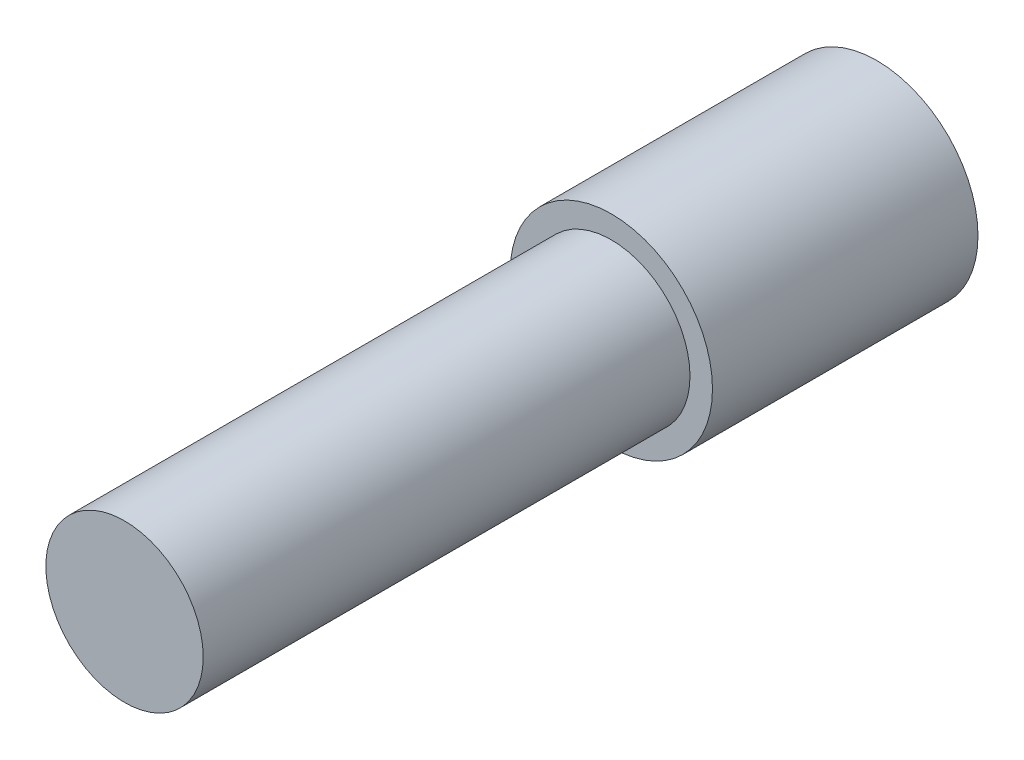
ISO-10303-21;
HEADER;
FILE_DESCRIPTION(('STEP AP214'),'2;1');
FILE_NAME('part.step','',(''),(''),'','','');
FILE_SCHEMA(('AUTOMOTIVE_DESIGN { 1 0 10303 214 1 1 1 1 }'));
ENDSEC;
DATA;
#1=APPLICATION_CONTEXT('core data for automotive mechanical design processes');
#2=APPLICATION_PROTOCOL_DEFINITION('international standard','automotive_design',2000,#1);
#3=PRODUCT_CONTEXT('',#1,'mechanical');
#4=PRODUCT('Part','Part','',(#3));
#5=PRODUCT_RELATED_PRODUCT_CATEGORY('part','',(#4));
#6=PRODUCT_DEFINITION_FORMATION('','',#4);
#7=PRODUCT_DEFINITION_CONTEXT('part definition',#1,'design');
#8=PRODUCT_DEFINITION('design','',#6,#7);
#9=PRODUCT_DEFINITION_SHAPE('','',#8);
#10=(LENGTH_UNIT() NAMED_UNIT(*) SI_UNIT(.MILLI.,.METRE.));
#11=(NAMED_UNIT(*) PLANE_ANGLE_UNIT() SI_UNIT($,.RADIAN.));
#12=(NAMED_UNIT(*) SI_UNIT($,.STERADIAN.) SOLID_ANGLE_UNIT());
#13=UNCERTAINTY_MEASURE_WITH_UNIT(LENGTH_MEASURE(1.E-05),#10,'distance_accuracy_value','');
#14=(GEOMETRIC_REPRESENTATION_CONTEXT(3) GLOBAL_UNCERTAINTY_ASSIGNED_CONTEXT((#13)) GLOBAL_UNIT_ASSIGNED_CONTEXT((#10,
#11,#12)) REPRESENTATION_CONTEXT('',''));
#15=CARTESIAN_POINT('',(0.,0.,0.));
#16=DIRECTION('',(0.,0.,1.));
#17=DIRECTION('',(1.,0.,0.));
#18=AXIS2_PLACEMENT_3D('',#15,#16,#17);
#19=CARTESIAN_POINT('',(0.,0.,6.));
#20=DIRECTION('',(0.,0.,-1.));
#21=DIRECTION('',(-1.,0.,0.));
#22=AXIS2_PLACEMENT_3D('',#19,#20,#21);
#23=CYLINDRICAL_SURFACE('',#22,2.286);
#24=CARTESIAN_POINT('',(0.,0.,6.));
#25=DIRECTION('',(0.,0.,1.));
#26=DIRECTION('',(1.,0.,0.));
#27=AXIS2_PLACEMENT_3D('',#24,#25,#26);
#28=CIRCLE('',#27,2.286);
#29=CARTESIAN_POINT('',(2.286,0.,6.));
#30=VERTEX_POINT('',#29);
#31=EDGE_CURVE('E45',#30,#30,#28,.T.);
#32=ORIENTED_EDGE('',*,*,#31,.F.);
#33=EDGE_LOOP('',(#32));
#34=FACE_BOUND('',#33,.T.);
#35=CARTESIAN_POINT('',(0.,0.,0.));
#36=DIRECTION('',(0.,0.,1.));
#37=DIRECTION('',(1.,0.,0.));
#38=AXIS2_PLACEMENT_3D('',#35,#36,#37);
#39=CIRCLE('',#38,2.286);
#40=CARTESIAN_POINT('',(2.286,0.,0.));
#41=VERTEX_POINT('',#40);
#42=EDGE_CURVE('E40',#41,#41,#39,.T.);
#43=ORIENTED_EDGE('',*,*,#42,.T.);
#44=EDGE_LOOP('',(#43));
#45=FACE_BOUND('',#44,.T.);
#46=ADVANCED_FACE('F37',(#34,#45),#23,.T.);
#47=CARTESIAN_POINT('',(0.,0.,6.));
#48=DIRECTION('',(0.,0.,1.));
#49=DIRECTION('',(1.,0.,0.));
#50=AXIS2_PLACEMENT_3D('',#47,#48,#49);
#51=PLANE('',#50);
#52=CARTESIAN_POINT('',(0.,0.,6.));
#53=DIRECTION('',(0.,0.,1.));
#54=DIRECTION('',(1.,0.,0.));
#55=AXIS2_PLACEMENT_3D('',#52,#53,#54);
#56=CIRCLE('',#55,1.778);
#57=CARTESIAN_POINT('',(1.778,0.,6.));
#58=VERTEX_POINT('',#57);
#59=EDGE_CURVE('E10',#58,#58,#56,.T.);
#60=ORIENTED_EDGE('',*,*,#59,.F.);
#61=EDGE_LOOP('',(#60));
#62=FACE_BOUND('',#61,.T.);
#63=ORIENTED_EDGE('',*,*,#31,.T.);
#64=EDGE_LOOP('',(#63));
#65=FACE_BOUND('',#64,.T.);
#66=ADVANCED_FACE('F65',(#62,#65),#51,.T.);
#67=CARTESIAN_POINT('',(0.,0.,0.));
#68=DIRECTION('',(0.,0.,1.));
#69=DIRECTION('',(1.,0.,0.));
#70=AXIS2_PLACEMENT_3D('',#67,#68,#69);
#71=PLANE('',#70);
#72=ORIENTED_EDGE('',*,*,#42,.F.);
#73=EDGE_LOOP('',(#72));
#74=FACE_BOUND('',#73,.T.);
#75=ADVANCED_FACE('F62',(#74),#71,.F.);
#76=CARTESIAN_POINT('',(0.,0.,17.));
#77=DIRECTION('',(0.,0.,-1.));
#78=DIRECTION('',(-1.,0.,0.));
#79=AXIS2_PLACEMENT_3D('',#76,#77,#78);
#80=CYLINDRICAL_SURFACE('',#79,1.778);
#81=CARTESIAN_POINT('',(0.,0.,17.));
#82=DIRECTION('',(0.,0.,1.));
#83=DIRECTION('',(1.,0.,0.));
#84=AXIS2_PLACEMENT_3D('',#81,#82,#83);
#85=CIRCLE('',#84,1.778);
#86=CARTESIAN_POINT('',(1.778,0.,17.));
#87=VERTEX_POINT('',#86);
#88=EDGE_CURVE('E52',#87,#87,#85,.T.);
#89=ORIENTED_EDGE('',*,*,#88,.F.);
#90=EDGE_LOOP('',(#89));
#91=FACE_BOUND('',#90,.T.);
#92=ORIENTED_EDGE('',*,*,#59,.T.);
#93=EDGE_LOOP('',(#92));
#94=FACE_BOUND('',#93,.T.);
#95=ADVANCED_FACE('F64',(#91,#94),#80,.T.);
#96=CARTESIAN_POINT('',(0.,0.,17.));
#97=DIRECTION('',(0.,0.,1.));
#98=DIRECTION('',(1.,0.,0.));
#99=AXIS2_PLACEMENT_3D('',#96,#97,#98);
#100=PLANE('',#99);
#101=ORIENTED_EDGE('',*,*,#88,.T.);
#102=EDGE_LOOP('',(#101));
#103=FACE_BOUND('',#102,.T.);
#104=ADVANCED_FACE('F70',(#103),#100,.T.);
#105=CLOSED_SHELL('',(#46,#66,#75,#95,#104));
#106=MANIFOLD_SOLID_BREP('B2',#105);
#107=ADVANCED_BREP_SHAPE_REPRESENTATION('',(#18,#106),#14);
#108=SHAPE_DEFINITION_REPRESENTATION(#9,#107);
ENDSEC;
END-ISO-10303-21;
